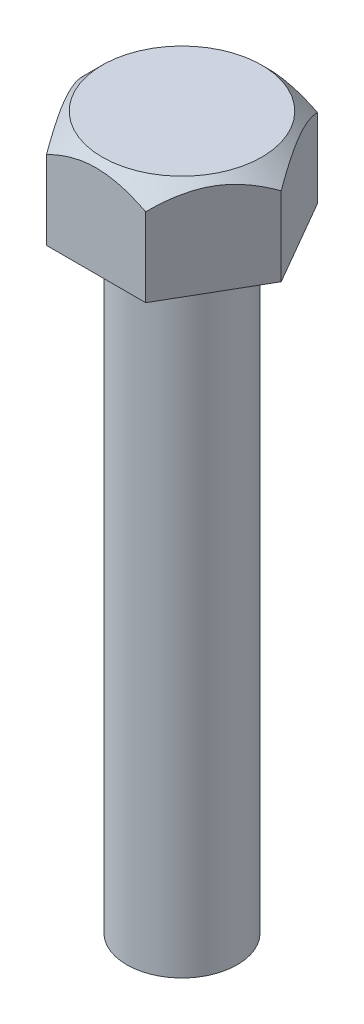
ISO-10303-21;
HEADER;
FILE_DESCRIPTION(('STEP AP214'),'2;1');
FILE_NAME('part.step','',(''),(''),'','','');
FILE_SCHEMA(('AUTOMOTIVE_DESIGN { 1 0 10303 214 1 1 1 1 }'));
ENDSEC;
DATA;
#1=APPLICATION_CONTEXT('core data for automotive mechanical design processes');
#2=APPLICATION_PROTOCOL_DEFINITION('international standard','automotive_design',2000,#1);
#3=PRODUCT_CONTEXT('',#1,'mechanical');
#4=PRODUCT('Part','Part','',(#3));
#5=PRODUCT_RELATED_PRODUCT_CATEGORY('part','',(#4));
#6=PRODUCT_DEFINITION_FORMATION('','',#4);
#7=PRODUCT_DEFINITION_CONTEXT('part definition',#1,'design');
#8=PRODUCT_DEFINITION('design','',#6,#7);
#9=PRODUCT_DEFINITION_SHAPE('','',#8);
#10=(LENGTH_UNIT() NAMED_UNIT(*) SI_UNIT(.MILLI.,.METRE.));
#11=(NAMED_UNIT(*) PLANE_ANGLE_UNIT() SI_UNIT($,.RADIAN.));
#12=(NAMED_UNIT(*) SI_UNIT($,.STERADIAN.) SOLID_ANGLE_UNIT());
#13=UNCERTAINTY_MEASURE_WITH_UNIT(LENGTH_MEASURE(1.E-05),#10,'distance_accuracy_value','');
#14=(GEOMETRIC_REPRESENTATION_CONTEXT(3) GLOBAL_UNCERTAINTY_ASSIGNED_CONTEXT((#13)) GLOBAL_UNIT_ASSIGNED_CONTEXT((#10,
#11,#12)) REPRESENTATION_CONTEXT('',''));
#15=CARTESIAN_POINT('',(0.,0.,0.));
#16=DIRECTION('',(0.,0.,1.));
#17=DIRECTION('',(1.,0.,0.));
#18=AXIS2_PLACEMENT_3D('',#15,#16,#17);
#19=CARTESIAN_POINT('',(2.02072594216369,29.,3.5));
#20=DIRECTION('',(-0.866025403784439,0.,-0.5));
#21=DIRECTION('',(-0.5,0.,0.866025403784439));
#22=AXIS2_PLACEMENT_3D('',#19,#20,#21);
#23=PLANE('',#22);
#24=CARTESIAN_POINT('',(2.02061047210985,28.2084326406702,3.5002));
#25=CARTESIAN_POINT('',(2.09007076582137,28.2778321819413,3.37989124218299));
#26=CARTESIAN_POINT('',(2.16069251433702,28.3431556368171,3.25757078563454));
#27=CARTESIAN_POINT('',(2.30469791501954,28.4627610639861,3.00814611508809));
#28=CARTESIAN_POINT('',(2.37809526074122,28.5169764927932,2.88101818315745));
#29=CARTESIAN_POINT('',(2.52609746963704,28.6098484404388,2.62467083771748));
#30=CARTESIAN_POINT('',(2.60066464532078,28.6487383754651,2.49551670085632));
#31=CARTESIAN_POINT('',(2.75144053111008,28.7086562112795,2.23436520611305));
#32=CARTESIAN_POINT('',(2.82764463582487,28.729728835325,2.10237582500172));
#33=CARTESIAN_POINT('',(2.9589800046599,28.7487420010243,1.87489629334866));
#34=CARTESIAN_POINT('',(3.01394167249194,28.7515564158127,1.77969989219485));
#35=CARTESIAN_POINT('',(3.12377560027761,28.7468134282327,1.58946194887522));
#36=CARTESIAN_POINT('',(3.17864782213826,28.7392523899156,1.49442047268838));
#37=CARTESIAN_POINT('',(3.28787240448756,28.7141902194182,1.3052379466239));
#38=CARTESIAN_POINT('',(3.34222411425439,28.6966779692925,1.21109802382951));
#39=CARTESIAN_POINT('',(3.4499940609728,28.6526692182783,1.02443500058423));
#40=CARTESIAN_POINT('',(3.50341236916323,28.6261734062083,0.931911776744037));
#41=CARTESIAN_POINT('',(3.59824414642312,28.5716601462383,0.767658320357847));
#42=CARTESIAN_POINT('',(3.63986754439452,28.5450758118228,0.695564480287723));
#43=CARTESIAN_POINT('',(3.72236709889696,28.4876227407093,0.552671060287706));
#44=CARTESIAN_POINT('',(3.76324323262423,28.4567538735092,0.481871519855082));
#45=CARTESIAN_POINT('',(3.84411947811356,28.3914237750285,0.341789753542154));
#46=CARTESIAN_POINT('',(3.88412189017022,28.3569738400217,0.272503543434723));
#47=CARTESIAN_POINT('',(3.96338588982946,28.2849340159573,0.135214268813787));
#48=CARTESIAN_POINT('',(4.00264791412852,28.2473460536121,0.0672104479198106));
#49=CARTESIAN_POINT('',(4.04156735438122,28.2084326406702,-0.000200000000000921));
#50=B_SPLINE_CURVE_WITH_KNOTS('',3,(#24,#25,#26,#27,#28,#29,#30,#31,#32,#33,#34,#35,#36,#37,#38,
#39,#40,#41,#42,#43,#44,#45,#46,#47,#48,#49),.UNSPECIFIED.,.F.,.F.,(4,2,2,2,2,2,2,2,2,2,2,2,4),
(0.,0.466195029511833,0.935106055247663,1.3965703522971,1.85687285909024,2.18628459516076,
2.51581179896771,2.845707891424,3.17557869467337,3.43762138891188,3.69967206642681,
3.96091985737577,4.22200840855896),.UNSPECIFIED.);
#51=CARTESIAN_POINT('',(2.02072594216369,28.2085481156726,3.5));
#52=VERTEX_POINT('',#51);
#53=CARTESIAN_POINT('',(4.04145188432738,28.2085481156726,0.));
#54=VERTEX_POINT('',#53);
#55=EDGE_CURVE('E92',#52,#54,#50,.T.);
#56=ORIENTED_EDGE('',*,*,#55,.F.);
#57=DIRECTION('',(0.,-1.,0.));
#58=VECTOR('',#57,1.);
#59=CARTESIAN_POINT('',(2.02072594216369,29.,3.5));
#60=LINE('',#59,#58);
#61=CARTESIAN_POINT('',(2.02072594216369,25.,3.5));
#62=VERTEX_POINT('',#61);
#63=EDGE_CURVE('E61',#52,#62,#60,.T.);
#64=ORIENTED_EDGE('',*,*,#63,.T.);
#65=DIRECTION('',(0.5,0.,-0.866025403784439));
#66=VECTOR('',#65,1.);
#67=CARTESIAN_POINT('',(2.02072594216369,25.,3.5));
#68=LINE('',#67,#66);
#69=CARTESIAN_POINT('',(4.04145188432738,25.,0.));
#70=VERTEX_POINT('',#69);
#71=EDGE_CURVE('E100',#62,#70,#68,.T.);
#72=ORIENTED_EDGE('',*,*,#71,.T.);
#73=DIRECTION('',(0.,-1.,0.));
#74=VECTOR('',#73,1.);
#75=CARTESIAN_POINT('',(4.04145188432738,29.,0.));
#76=LINE('',#75,#74);
#77=EDGE_CURVE('E99',#54,#70,#76,.T.);
#78=ORIENTED_EDGE('',*,*,#77,.F.);
#79=EDGE_LOOP('',(#56,#64,#72,#78));
#80=FACE_BOUND('',#79,.T.);
#81=ADVANCED_FACE('F38',(#80),#23,.F.);
#82=CARTESIAN_POINT('',(4.04145188432738,29.,0.));
#83=DIRECTION('',(-0.866025403784438,0.,0.5));
#84=DIRECTION('',(0.5,0.,0.866025403784438));
#85=AXIS2_PLACEMENT_3D('',#82,#83,#84);
#86=PLANE('',#85);
#87=CARTESIAN_POINT('',(4.04156735438122,28.2084326406702,0.000199999999999219));
#88=CARTESIAN_POINT('',(3.9721070606697,28.2778321819413,-0.120108757817011));
#89=CARTESIAN_POINT('',(3.90148531215405,28.3431556368171,-0.242429214365461));
#90=CARTESIAN_POINT('',(3.75747991147153,28.4627610639861,-0.491853884911908));
#91=CARTESIAN_POINT('',(3.68408256574985,28.5169764927932,-0.618981816842553));
#92=CARTESIAN_POINT('',(3.53608035685403,28.6098484404388,-0.875329162282526));
#93=CARTESIAN_POINT('',(3.46151318117029,28.6487383754651,-1.00448329914368));
#94=CARTESIAN_POINT('',(3.31073729538099,28.7086562112795,-1.26563479388695));
#95=CARTESIAN_POINT('',(3.2345331906662,28.729728835325,-1.39762417499828));
#96=CARTESIAN_POINT('',(3.10319782183117,28.7487420010243,-1.62510370665135));
#97=CARTESIAN_POINT('',(3.04823615399913,28.7515564158127,-1.72030010780516));
#98=CARTESIAN_POINT('',(2.93840222621346,28.7468134282327,-1.91053805112478));
#99=CARTESIAN_POINT('',(2.88353000435281,28.7392523899156,-2.00557952731162));
#100=CARTESIAN_POINT('',(2.77430542200351,28.7141902194182,-2.1947620533761));
#101=CARTESIAN_POINT('',(2.71995371223668,28.6966779692925,-2.2889019761705));
#102=CARTESIAN_POINT('',(2.61218376551827,28.6526692182783,-2.47556499941577));
#103=CARTESIAN_POINT('',(2.55876545732784,28.6261734062083,-2.56808822325597));
#104=CARTESIAN_POINT('',(2.46393368006795,28.5716601462383,-2.73234167964216));
#105=CARTESIAN_POINT('',(2.42231028209655,28.5450758118228,-2.80443551971228));
#106=CARTESIAN_POINT('',(2.33981072759411,28.4876227407093,-2.9473289397123));
#107=CARTESIAN_POINT('',(2.29893459386683,28.4567538735092,-3.01812848014492));
#108=CARTESIAN_POINT('',(2.21805834837751,28.3914237750285,-3.15821024645785));
#109=CARTESIAN_POINT('',(2.17805593632085,28.3569738400217,-3.22749645656528));
#110=CARTESIAN_POINT('',(2.09879193666161,28.2849340159573,-3.36478573118621));
#111=CARTESIAN_POINT('',(2.05952991236255,28.2473460536121,-3.43278955208019));
#112=CARTESIAN_POINT('',(2.02061047210985,28.2084326406702,-3.5002));
#113=B_SPLINE_CURVE_WITH_KNOTS('',3,(#87,#88,#89,#90,#91,#92,#93,#94,#95,#96,#97,#98,#99,#100,
#101,#102,#103,#104,#105,#106,#107,#108,#109,#110,#111,#112),.UNSPECIFIED.,.F.,.F.,(4,2,2,2,2,2,
2,2,2,2,2,2,4),(0.,0.466195029511835,0.935106055247666,1.3965703522971,1.85687285909025,
2.18628459516077,2.51581179896771,2.845707891424,3.17557869467337,3.43762138891189,
3.69967206642681,3.96091985737577,4.22200840855896),.UNSPECIFIED.);
#114=CARTESIAN_POINT('',(2.02072594216588,28.2085481156727,-3.5));
#115=VERTEX_POINT('',#114);
#116=EDGE_CURVE('E101',#54,#115,#113,.T.);
#117=ORIENTED_EDGE('',*,*,#116,.F.);
#118=ORIENTED_EDGE('',*,*,#77,.T.);
#119=DIRECTION('',(-0.5,0.,-0.866025403784438));
#120=VECTOR('',#119,1.);
#121=CARTESIAN_POINT('',(4.04145188432738,25.,0.));
#122=LINE('',#121,#120);
#123=CARTESIAN_POINT('',(2.02072594216369,25.,-3.5));
#124=VERTEX_POINT('',#123);
#125=EDGE_CURVE('E310',#70,#124,#122,.T.);
#126=ORIENTED_EDGE('',*,*,#125,.T.);
#127=DIRECTION('',(0.,-1.,0.));
#128=VECTOR('',#127,1.);
#129=CARTESIAN_POINT('',(2.02072594216369,29.,-3.5));
#130=LINE('',#129,#128);
#131=EDGE_CURVE('E118',#115,#124,#130,.T.);
#132=ORIENTED_EDGE('',*,*,#131,.F.);
#133=EDGE_LOOP('',(#117,#118,#126,#132));
#134=FACE_BOUND('',#133,.T.);
#135=ADVANCED_FACE('F139',(#134),#86,.F.);
#136=CARTESIAN_POINT('',(2.02072594216369,29.,-3.5));
#137=DIRECTION('',(0.,0.,1.));
#138=DIRECTION('',(1.,0.,0.));
#139=AXIS2_PLACEMENT_3D('',#136,#137,#138);
#140=PLANE('',#139);
#141=CARTESIAN_POINT('',(7.70716664524102,23.7853430254076,-3.5));
#142=CARTESIAN_POINT('',(7.48137878493621,23.990864738311,-3.5));
#143=CARTESIAN_POINT('',(7.25487498305033,24.1956103190715,-3.5));
#144=CARTESIAN_POINT('',(6.79984084265897,24.6029554533115,-3.5));
#145=CARTESIAN_POINT('',(6.57130998936556,24.8055544312053,-3.5));
#146=CARTESIAN_POINT('',(6.10997227237162,25.2094561203308,-3.5));
#147=CARTESIAN_POINT('',(5.87714602281739,25.4107367785887,-3.5));
#148=CARTESIAN_POINT('',(5.52538737480416,25.7096554363448,-3.5));
#149=CARTESIAN_POINT('',(5.40772405447227,25.8087868497351,-3.5));
#150=CARTESIAN_POINT('',(5.17140128385372,26.0058714944853,-3.5));
#151=CARTESIAN_POINT('',(5.05274176897768,26.1038246484339,-3.5));
#152=CARTESIAN_POINT('',(4.72855665814677,26.3682372764227,-3.5));
#153=CARTESIAN_POINT('',(4.52190647560976,26.5333236577724,-3.5));
#154=CARTESIAN_POINT('',(4.10413126511783,26.857737279714,-3.5));
#155=CARTESIAN_POINT('',(3.89300676148951,27.0170651892613,-3.5));
#156=CARTESIAN_POINT('',(3.57190983710472,27.2496843353503,-3.5));
#157=CARTESIAN_POINT('',(3.46421302882779,27.3261149199009,-3.5));
#158=CARTESIAN_POINT('',(3.24704746965091,27.4764102809614,-3.5));
#159=CARTESIAN_POINT('',(3.13757882856852,27.5502752156033,-3.5));
#160=CARTESIAN_POINT('',(2.91663090789853,27.6948095752396,-3.5));
#161=CARTESIAN_POINT('',(2.805152799562,27.7654807825477,-3.5));
#162=CARTESIAN_POINT('',(2.57979608614745,27.9028900075283,-3.5));
#163=CARTESIAN_POINT('',(2.46591757085952,27.9696281719677,-3.5));
#164=CARTESIAN_POINT('',(2.23926046454426,28.0959963731595,-3.5));
#165=CARTESIAN_POINT('',(2.12657447565633,28.1557902941685,-3.5));
#166=CARTESIAN_POINT('',(1.89832432470709,28.2695697545064,-3.5));
#167=CARTESIAN_POINT('',(1.78275963062833,28.3235542102242,-3.5));
#168=CARTESIAN_POINT('',(1.43160000307182,28.4744265078049,-3.5));
#169=CARTESIAN_POINT('',(1.19096103072813,28.5605724518729,-3.5));
#170=CARTESIAN_POINT('',(0.844192800517524,28.6509389744605,-3.5));
#171=CARTESIAN_POINT('',(0.742755831599193,28.6734700859226,-3.5));
#172=CARTESIAN_POINT('',(0.538372515731154,28.710260537644,-3.5));
#173=CARTESIAN_POINT('',(0.435426387793829,28.7245210661996,-3.5));
#174=CARTESIAN_POINT('',(0.228874710706779,28.7440284506105,-3.5));
#175=CARTESIAN_POINT('',(0.125270816613507,28.7492926404895,-3.5));
#176=CARTESIAN_POINT('',(-0.0819976482621305,28.7505736059931,-3.5));
#177=CARTESIAN_POINT('',(-0.185662219919042,28.7465902448792,-3.5));
#178=CARTESIAN_POINT('',(-0.391954552758978,28.7296186785698,-3.5));
#179=CARTESIAN_POINT('',(-0.494584371532753,28.7166550805322,-3.5));
#180=CARTESIAN_POINT('',(-0.69845096177407,28.6824060166348,-3.5));
#181=CARTESIAN_POINT('',(-0.799687393970877,28.6611185598784,-3.5));
#182=CARTESIAN_POINT('',(-1.00055886357535,28.6110957151298,-3.5));
#183=CARTESIAN_POINT('',(-1.10018908438169,28.5823412147177,-3.5));
#184=CARTESIAN_POINT('',(-1.29735290848498,28.5184556116406,-3.5));
#185=CARTESIAN_POINT('',(-1.39488662725708,28.4833248611907,-3.5));
#186=CARTESIAN_POINT('',(-1.62398143894392,28.393522835092,-3.5));
#187=CARTESIAN_POINT('',(-1.75460225208164,28.3364614936028,-3.5));
#188=CARTESIAN_POINT('',(-2.01212538243932,28.2144355971307,-3.5));
#189=CARTESIAN_POINT('',(-2.13902566051998,28.1494668051478,-3.5));
#190=CARTESIAN_POINT('',(-2.38975030564642,28.0132787478499,-3.5));
#191=CARTESIAN_POINT('',(-2.51356756500158,27.9420464963877,-3.5));
#192=CARTESIAN_POINT('',(-2.75828903960432,27.7948220965912,-3.5));
#193=CARTESIAN_POINT('',(-2.87919376849558,27.7188307961824,-3.5));
#194=CARTESIAN_POINT('',(-3.11981544610214,27.5622695569284,-3.5));
#195=CARTESIAN_POINT('',(-3.23950628239306,27.4816596727114,-3.5));
#196=CARTESIAN_POINT('',(-3.47678034146727,27.3173864559665,-3.5));
#197=CARTESIAN_POINT('',(-3.59436338889632,27.2337228711325,-3.5));
#198=CARTESIAN_POINT('',(-3.82759534323741,27.0640483819622,-3.5));
#199=CARTESIAN_POINT('',(-3.94324646957738,26.9780405198824,-3.5));
#200=CARTESIAN_POINT('',(-4.17303756356098,26.8040274731239,-3.5));
#201=CARTESIAN_POINT('',(-4.28717748943524,26.7160222334197,-3.5));
#202=CARTESIAN_POINT('',(-4.54597443286471,26.5134775488887,-3.5));
#203=CARTESIAN_POINT('',(-4.69022023284845,26.3984132003865,-3.5));
#204=CARTESIAN_POINT('',(-4.97697874841413,26.166146458185,-3.5));
#205=CARTESIAN_POINT('',(-5.11949143591914,26.0489440299248,-3.5));
#206=CARTESIAN_POINT('',(-5.54501613076944,25.6946694881432,-3.5));
#207=CARTESIAN_POINT('',(-5.82588928926461,25.4550295631682,-3.5));
#208=CARTESIAN_POINT('',(-6.37505783002073,24.9785890776849,-3.5));
#209=CARTESIAN_POINT('',(-6.64347451864522,24.7419274895939,-3.5));
#210=CARTESIAN_POINT('',(-7.04391472975608,24.3846885484034,-3.5));
#211=CARTESIAN_POINT('',(-7.17698223407642,24.2652787040679,-3.5));
#212=CARTESIAN_POINT('',(-7.44250845068641,24.0257883304083,-3.5));
#213=CARTESIAN_POINT('',(-7.57496717311672,23.9057078123301,-3.5));
#214=CARTESIAN_POINT('',(-7.70716664524102,23.7853430254076,-3.5));
#215=B_SPLINE_CURVE_WITH_KNOTS('',3,(#141,#142,#143,#144,#145,#146,#147,#148,#149,#150,#151,
#152,#153,#154,#155,#156,#157,#158,#159,#160,#161,#162,#163,#164,#165,#166,#167,#168,#169,#170,
#171,#172,#173,#174,#175,#176,#177,#178,#179,#180,#181,#182,#183,#184,#185,#186,#187,#188,#189,
#190,#191,#192,#193,#194,#195,#196,#197,#198,#199,#200,#201,#202,#203,#204,#205,#206,#207,#208,
#209,#210,#211,#212,#213,#214),.UNSPECIFIED.,.F.,.F.,(4,2,2,2,2,2,2,2,2,2,2,2,2,2,2,2,2,2,2,2,2,
2,2,2,2,2,2,2,2,2,2,2,2,2,2,2,4),(0.,0.915963363141742,1.8321664126931,2.75543658827209,
3.21699839490496,3.67859036214388,4.47201065044676,5.26533846978212,5.66149422375699,
6.05762551745641,6.45353294218932,6.84942558372157,7.23195625738918,7.6145581594123,
8.3777588455119,8.68921200357338,9.00062040174318,9.31142810308282,9.62224040019004,
9.93220437785494,10.2422425379534,10.5530822212853,10.8639047394964,11.2911653487573,
11.7186559107035,12.1470546944636,12.5753773658633,13.0082330710391,13.4411246213995,
13.8734788882472,14.3058450804653,14.8593699513852,15.412903777658,16.5204516115594,
17.5939713743935,18.1303377588253,18.6666951762194),.UNSPECIFIED.);
#216=CARTESIAN_POINT('',(-2.02072594216369,28.2085481156726,-3.5));
#217=VERTEX_POINT('',#216);
#218=EDGE_CURVE('E190',#115,#217,#215,.T.);
#219=ORIENTED_EDGE('',*,*,#218,.F.);
#220=ORIENTED_EDGE('',*,*,#131,.T.);
#221=DIRECTION('',(-1.,0.,0.));
#222=VECTOR('',#221,1.);
#223=CARTESIAN_POINT('',(2.02072594216369,25.,-3.5));
#224=LINE('',#223,#222);
#225=CARTESIAN_POINT('',(-2.02072594216369,25.,-3.5));
#226=VERTEX_POINT('',#225);
#227=EDGE_CURVE('E307',#124,#226,#224,.T.);
#228=ORIENTED_EDGE('',*,*,#227,.T.);
#229=DIRECTION('',(0.,-1.,0.));
#230=VECTOR('',#229,1.);
#231=CARTESIAN_POINT('',(-2.02072594216369,29.,-3.5));
#232=LINE('',#231,#230);
#233=EDGE_CURVE('E116',#217,#226,#232,.T.);
#234=ORIENTED_EDGE('',*,*,#233,.F.);
#235=EDGE_LOOP('',(#219,#220,#228,#234));
#236=FACE_BOUND('',#235,.T.);
#237=ADVANCED_FACE('F143',(#236),#140,.F.);
#238=CARTESIAN_POINT('',(-2.02072594216369,29.,-3.5));
#239=DIRECTION('',(0.866025403784439,0.,0.5));
#240=DIRECTION('',(0.5,0.,-0.866025403784439));
#241=AXIS2_PLACEMENT_3D('',#238,#239,#240);
#242=PLANE('',#241);
#243=CARTESIAN_POINT('',(-2.02061047210985,28.2084326406702,-3.5002));
#244=CARTESIAN_POINT('',(-2.09007076582137,28.2778321819413,-3.37989124218299));
#245=CARTESIAN_POINT('',(-2.16069251433702,28.3431556368171,-3.25757078563454));
#246=CARTESIAN_POINT('',(-2.30469791501954,28.4627610639861,-3.00814611508809));
#247=CARTESIAN_POINT('',(-2.37809526074122,28.5169764927932,-2.88101818315745));
#248=CARTESIAN_POINT('',(-2.52609746963703,28.6098484404388,-2.62467083771748));
#249=CARTESIAN_POINT('',(-2.60066464532078,28.6487383754651,-2.49551670085632));
#250=CARTESIAN_POINT('',(-2.75144053111008,28.7086562112795,-2.23436520611305));
#251=CARTESIAN_POINT('',(-2.82764463582487,28.729728835325,-2.10237582500172));
#252=CARTESIAN_POINT('',(-2.9589800046599,28.7487420010243,-1.87489629334865));
#253=CARTESIAN_POINT('',(-3.01394167249194,28.7515564158127,-1.77969989219484));
#254=CARTESIAN_POINT('',(-3.12377560027761,28.7468134282327,-1.58946194887522));
#255=CARTESIAN_POINT('',(-3.17864782213826,28.7392523899156,-1.49442047268838));
#256=CARTESIAN_POINT('',(-3.28787240448756,28.7141902194182,-1.3052379466239));
#257=CARTESIAN_POINT('',(-3.34222411425439,28.6966779692925,-1.2110980238295));
#258=CARTESIAN_POINT('',(-3.4499940609728,28.6526692182783,-1.02443500058423));
#259=CARTESIAN_POINT('',(-3.50341236916323,28.6261734062083,-0.931911776744034));
#260=CARTESIAN_POINT('',(-3.59824414642312,28.5716601462383,-0.767658320357843));
#261=CARTESIAN_POINT('',(-3.63986754439452,28.5450758118228,-0.695564480287718));
#262=CARTESIAN_POINT('',(-3.72236709889696,28.4876227407093,-0.552671060287703));
#263=CARTESIAN_POINT('',(-3.76324323262423,28.4567538735092,-0.48187151985508));
#264=CARTESIAN_POINT('',(-3.84411947811356,28.3914237750285,-0.341789753542153));
#265=CARTESIAN_POINT('',(-3.88412189017022,28.3569738400217,-0.272503543434722));
#266=CARTESIAN_POINT('',(-3.96338588982946,28.2849340159573,-0.135214268813785));
#267=CARTESIAN_POINT('',(-4.00264791412852,28.2473460536121,-0.0672104479198091));
#268=CARTESIAN_POINT('',(-4.04156735438122,28.2084326406702,0.000200000000000683));
#269=B_SPLINE_CURVE_WITH_KNOTS('',3,(#243,#244,#245,#246,#247,#248,#249,#250,#251,#252,#253,
#254,#255,#256,#257,#258,#259,#260,#261,#262,#263,#264,#265,#266,#267,#268),.UNSPECIFIED.,.F.,
.F.,(4,2,2,2,2,2,2,2,2,2,2,2,4),(0.,0.466195029511834,0.935106055247666,1.3965703522971,
1.85687285909025,2.18628459516077,2.51581179896772,2.845707891424,3.17557869467338,
3.43762138891189,3.69967206642681,3.96091985737577,4.22200840855896),.UNSPECIFIED.);
#270=CARTESIAN_POINT('',(-4.04145188432738,28.2085481156726,0.));
#271=VERTEX_POINT('',#270);
#272=EDGE_CURVE('E184',#217,#271,#269,.T.);
#273=ORIENTED_EDGE('',*,*,#272,.F.);
#274=ORIENTED_EDGE('',*,*,#233,.T.);
#275=DIRECTION('',(-0.5,0.,0.866025403784439));
#276=VECTOR('',#275,1.);
#277=CARTESIAN_POINT('',(-2.02072594216369,25.,-3.5));
#278=LINE('',#277,#276);
#279=CARTESIAN_POINT('',(-4.04145188432738,25.,0.));
#280=VERTEX_POINT('',#279);
#281=EDGE_CURVE('E302',#226,#280,#278,.T.);
#282=ORIENTED_EDGE('',*,*,#281,.T.);
#283=DIRECTION('',(0.,-1.,0.));
#284=VECTOR('',#283,1.);
#285=CARTESIAN_POINT('',(-4.04145188432738,29.,0.));
#286=LINE('',#285,#284);
#287=EDGE_CURVE('E109',#271,#280,#286,.T.);
#288=ORIENTED_EDGE('',*,*,#287,.F.);
#289=EDGE_LOOP('',(#273,#274,#282,#288));
#290=FACE_BOUND('',#289,.T.);
#291=ADVANCED_FACE('F197',(#290),#242,.F.);
#292=CARTESIAN_POINT('',(-4.04145188432738,29.,0.));
#293=DIRECTION('',(0.866025403784439,0.,-0.5));
#294=DIRECTION('',(-0.5,0.,-0.866025403784439));
#295=AXIS2_PLACEMENT_3D('',#292,#293,#294);
#296=PLANE('',#295);
#297=CARTESIAN_POINT('',(-4.04156735438122,28.2084326406702,-0.000199999999999135));
#298=CARTESIAN_POINT('',(-3.9721070606697,28.2778321819413,0.12010875781701));
#299=CARTESIAN_POINT('',(-3.90148531215405,28.3431556368171,0.24242921436546));
#300=CARTESIAN_POINT('',(-3.75747991147153,28.4627610639861,0.491853884911908));
#301=CARTESIAN_POINT('',(-3.68408256574985,28.5169764927932,0.618981816842554));
#302=CARTESIAN_POINT('',(-3.53608035685403,28.6098484404388,0.875329162282526));
#303=CARTESIAN_POINT('',(-3.46151318117029,28.6487383754651,1.00448329914368));
#304=CARTESIAN_POINT('',(-3.31073729538099,28.7086562112795,1.26563479388695));
#305=CARTESIAN_POINT('',(-3.23453319066619,28.729728835325,1.39762417499828));
#306=CARTESIAN_POINT('',(-3.10319782183117,28.7487420010243,1.62510370665135));
#307=CARTESIAN_POINT('',(-3.04823615399913,28.7515564158127,1.72030010780516));
#308=CARTESIAN_POINT('',(-2.93840222621346,28.7468134282327,1.91053805112478));
#309=CARTESIAN_POINT('',(-2.88353000435281,28.7392523899156,2.00557952731162));
#310=CARTESIAN_POINT('',(-2.77430542200351,28.7141902194182,2.1947620533761));
#311=CARTESIAN_POINT('',(-2.71995371223668,28.6966779692925,2.2889019761705));
#312=CARTESIAN_POINT('',(-2.61218376551827,28.6526692182783,2.47556499941577));
#313=CARTESIAN_POINT('',(-2.55876545732784,28.6261734062083,2.56808822325597));
#314=CARTESIAN_POINT('',(-2.46393368006795,28.5716601462383,2.73234167964216));
#315=CARTESIAN_POINT('',(-2.42231028209655,28.5450758118228,2.80443551971228));
#316=CARTESIAN_POINT('',(-2.33981072759411,28.4876227407093,2.9473289397123));
#317=CARTESIAN_POINT('',(-2.29893459386683,28.4567538735092,3.01812848014492));
#318=CARTESIAN_POINT('',(-2.21805834837751,28.3914237750285,3.15821024645785));
#319=CARTESIAN_POINT('',(-2.17805593632085,28.3569738400216,3.22749645656528));
#320=CARTESIAN_POINT('',(-2.09879193666161,28.2849340159573,3.36478573118621));
#321=CARTESIAN_POINT('',(-2.05952991236255,28.2473460536121,3.43278955208019));
#322=CARTESIAN_POINT('',(-2.02061047210985,28.2084326406702,3.5002));
#323=B_SPLINE_CURVE_WITH_KNOTS('',3,(#297,#298,#299,#300,#301,#302,#303,#304,#305,#306,#307,
#308,#309,#310,#311,#312,#313,#314,#315,#316,#317,#318,#319,#320,#321,#322),.UNSPECIFIED.,.F.,
.F.,(4,2,2,2,2,2,2,2,2,2,2,2,4),(0.,0.466195029511834,0.935106055247666,1.3965703522971,
1.85687285909025,2.18628459516077,2.51581179896771,2.845707891424,3.17557869467337,
3.43762138891189,3.69967206642681,3.96091985737577,4.22200840855896),.UNSPECIFIED.);
#324=CARTESIAN_POINT('',(-2.02072594216369,28.2085481156726,3.5));
#325=VERTEX_POINT('',#324);
#326=EDGE_CURVE('E53',#271,#325,#323,.T.);
#327=ORIENTED_EDGE('',*,*,#326,.F.);
#328=ORIENTED_EDGE('',*,*,#287,.T.);
#329=DIRECTION('',(0.5,0.,0.866025403784439));
#330=VECTOR('',#329,1.);
#331=CARTESIAN_POINT('',(-4.04145188432738,25.,0.));
#332=LINE('',#331,#330);
#333=CARTESIAN_POINT('',(-2.02072594216369,25.,3.5));
#334=VERTEX_POINT('',#333);
#335=EDGE_CURVE('E111',#280,#334,#332,.T.);
#336=ORIENTED_EDGE('',*,*,#335,.T.);
#337=DIRECTION('',(0.,-1.,0.));
#338=VECTOR('',#337,1.);
#339=CARTESIAN_POINT('',(-2.02072594216369,29.,3.5));
#340=LINE('',#339,#338);
#341=EDGE_CURVE('E107',#325,#334,#340,.T.);
#342=ORIENTED_EDGE('',*,*,#341,.F.);
#343=EDGE_LOOP('',(#327,#328,#336,#342));
#344=FACE_BOUND('',#343,.T.);
#345=ADVANCED_FACE('F201',(#344),#296,.F.);
#346=CARTESIAN_POINT('',(-2.02072594216369,29.,3.5));
#347=DIRECTION('',(0.,0.,-1.));
#348=DIRECTION('',(-1.,0.,0.));
#349=AXIS2_PLACEMENT_3D('',#346,#347,#348);
#350=PLANE('',#349);
#351=CARTESIAN_POINT('',(-7.70716664524102,23.7853430254076,3.5));
#352=CARTESIAN_POINT('',(-7.48137878493621,23.990864738311,3.5));
#353=CARTESIAN_POINT('',(-7.25487498305033,24.1956103190715,3.5));
#354=CARTESIAN_POINT('',(-6.79984084265897,24.6029554533115,3.5));
#355=CARTESIAN_POINT('',(-6.57130998936556,24.8055544312053,3.5));
#356=CARTESIAN_POINT('',(-6.10997227237161,25.2094561203308,3.5));
#357=CARTESIAN_POINT('',(-5.87714602281739,25.4107367785887,3.5));
#358=CARTESIAN_POINT('',(-5.52538737480416,25.7096554363448,3.5));
#359=CARTESIAN_POINT('',(-5.40772405447227,25.8087868497351,3.5));
#360=CARTESIAN_POINT('',(-5.17140128385372,26.0058714944853,3.5));
#361=CARTESIAN_POINT('',(-5.05274176897768,26.1038246484339,3.5));
#362=CARTESIAN_POINT('',(-4.72855665814677,26.3682372764227,3.5));
#363=CARTESIAN_POINT('',(-4.52190647560975,26.5333236577724,3.5));
#364=CARTESIAN_POINT('',(-4.10413126511783,26.857737279714,3.5));
#365=CARTESIAN_POINT('',(-3.89300676148951,27.0170651892613,3.5));
#366=CARTESIAN_POINT('',(-3.57190983710472,27.2496843353503,3.5));
#367=CARTESIAN_POINT('',(-3.46421302882779,27.3261149199009,3.5));
#368=CARTESIAN_POINT('',(-3.24704746965091,27.4764102809614,3.5));
#369=CARTESIAN_POINT('',(-3.13757882856852,27.5502752156033,3.5));
#370=CARTESIAN_POINT('',(-2.91663090789853,27.6948095752396,3.5));
#371=CARTESIAN_POINT('',(-2.805152799562,27.7654807825477,3.5));
#372=CARTESIAN_POINT('',(-2.57979608614745,27.9028900075283,3.5));
#373=CARTESIAN_POINT('',(-2.46591757085952,27.9696281719677,3.5));
#374=CARTESIAN_POINT('',(-2.23926046454426,28.0959963731595,3.5));
#375=CARTESIAN_POINT('',(-2.12657447565633,28.1557902941685,3.5));
#376=CARTESIAN_POINT('',(-1.89832432470709,28.2695697545064,3.5));
#377=CARTESIAN_POINT('',(-1.78275963062833,28.3235542102242,3.5));
#378=CARTESIAN_POINT('',(-1.43160000307182,28.4744265078049,3.5));
#379=CARTESIAN_POINT('',(-1.19096103072814,28.5605724518729,3.5));
#380=CARTESIAN_POINT('',(-0.844192800517525,28.6509389744605,3.5));
#381=CARTESIAN_POINT('',(-0.742755831599195,28.6734700859226,3.5));
#382=CARTESIAN_POINT('',(-0.538372515731155,28.710260537644,3.5));
#383=CARTESIAN_POINT('',(-0.435426387793831,28.7245210661996,3.5));
#384=CARTESIAN_POINT('',(-0.22887471070678,28.7440284506105,3.5));
#385=CARTESIAN_POINT('',(-0.125270816613508,28.7492926404896,3.5));
#386=CARTESIAN_POINT('',(0.0819976482621295,28.7505736059931,3.5));
#387=CARTESIAN_POINT('',(0.185662219919041,28.7465902448792,3.5));
#388=CARTESIAN_POINT('',(0.391954552758978,28.7296186785698,3.5));
#389=CARTESIAN_POINT('',(0.494584371532753,28.7166550805322,3.5));
#390=CARTESIAN_POINT('',(0.69845096177407,28.6824060166348,3.5));
#391=CARTESIAN_POINT('',(0.799687393970876,28.6611185598784,3.5));
#392=CARTESIAN_POINT('',(1.00055886357535,28.6110957151298,3.5));
#393=CARTESIAN_POINT('',(1.10018908438169,28.5823412147177,3.5));
#394=CARTESIAN_POINT('',(1.29735290848498,28.5184556116406,3.5));
#395=CARTESIAN_POINT('',(1.39488662725708,28.4833248611907,3.5));
#396=CARTESIAN_POINT('',(1.62398143894392,28.393522835092,3.5));
#397=CARTESIAN_POINT('',(1.75460225208164,28.3364614936028,3.5));
#398=CARTESIAN_POINT('',(2.01212538243932,28.2144355971307,3.5));
#399=CARTESIAN_POINT('',(2.13902566051998,28.1494668051478,3.5));
#400=CARTESIAN_POINT('',(2.38975030564642,28.0132787478499,3.5));
#401=CARTESIAN_POINT('',(2.51356756500158,27.9420464963877,3.5));
#402=CARTESIAN_POINT('',(2.75828903960432,27.7948220965912,3.5));
#403=CARTESIAN_POINT('',(2.87919376849558,27.7188307961824,3.5));
#404=CARTESIAN_POINT('',(3.11981544610214,27.5622695569284,3.5));
#405=CARTESIAN_POINT('',(3.23950628239306,27.4816596727114,3.5));
#406=CARTESIAN_POINT('',(3.47678034146727,27.3173864559665,3.5));
#407=CARTESIAN_POINT('',(3.59436338889632,27.2337228711325,3.5));
#408=CARTESIAN_POINT('',(3.8275953432374,27.0640483819622,3.5));
#409=CARTESIAN_POINT('',(3.94324646957737,26.9780405198824,3.5));
#410=CARTESIAN_POINT('',(4.17303756356097,26.8040274731239,3.5));
#411=CARTESIAN_POINT('',(4.28717748943523,26.7160222334197,3.5));
#412=CARTESIAN_POINT('',(4.5459744328647,26.5134775488887,3.5));
#413=CARTESIAN_POINT('',(4.69022023284844,26.3984132003865,3.5));
#414=CARTESIAN_POINT('',(4.97697874841412,26.166146458185,3.5));
#415=CARTESIAN_POINT('',(5.11949143591913,26.0489440299248,3.5));
#416=CARTESIAN_POINT('',(5.54501613076943,25.6946694881432,3.5));
#417=CARTESIAN_POINT('',(5.82588928926461,25.4550295631683,3.5));
#418=CARTESIAN_POINT('',(6.37505783002073,24.9785890776849,3.5));
#419=CARTESIAN_POINT('',(6.64347451864521,24.7419274895939,3.5));
#420=CARTESIAN_POINT('',(7.04391472975607,24.3846885484034,3.5));
#421=CARTESIAN_POINT('',(7.17698223407642,24.2652787040679,3.5));
#422=CARTESIAN_POINT('',(7.44250845068641,24.0257883304083,3.5));
#423=CARTESIAN_POINT('',(7.57496717311672,23.9057078123301,3.5));
#424=CARTESIAN_POINT('',(7.70716664524102,23.7853430254076,3.5));
#425=B_SPLINE_CURVE_WITH_KNOTS('',3,(#351,#352,#353,#354,#355,#356,#357,#358,#359,#360,#361,
#362,#363,#364,#365,#366,#367,#368,#369,#370,#371,#372,#373,#374,#375,#376,#377,#378,#379,#380,
#381,#382,#383,#384,#385,#386,#387,#388,#389,#390,#391,#392,#393,#394,#395,#396,#397,#398,#399,
#400,#401,#402,#403,#404,#405,#406,#407,#408,#409,#410,#411,#412,#413,#414,#415,#416,#417,#418,
#419,#420,#421,#422,#423,#424),.UNSPECIFIED.,.F.,.F.,(4,2,2,2,2,2,2,2,2,2,2,2,2,2,2,2,2,2,2,2,2,
2,2,2,2,2,2,2,2,2,2,2,2,2,2,2,4),(0.,0.915963363141743,1.8321664126931,2.75543658827209,
3.21699839490496,3.67859036214388,4.47201065044676,5.26533846978212,5.66149422375699,
6.05762551745641,6.45353294218932,6.84942558372157,7.23195625738918,7.6145581594123,
8.3777588455119,8.68921200357338,9.00062040174318,9.31142810308282,9.62224040019004,
9.93220437785494,10.2422425379534,10.5530822212853,10.8639047394964,11.2911653487573,
11.7186559107035,12.1470546944636,12.5753773658633,13.0082330710391,13.4411246213995,
13.8734788882472,14.3058450804653,14.8593699513852,15.412903777658,16.5204516115594,
17.5939713743935,18.1303377588253,18.6666951762194),.UNSPECIFIED.);
#426=EDGE_CURVE('E90',#325,#52,#425,.T.);
#427=ORIENTED_EDGE('',*,*,#426,.F.);
#428=ORIENTED_EDGE('',*,*,#341,.T.);
#429=DIRECTION('',(1.,0.,0.));
#430=VECTOR('',#429,1.);
#431=CARTESIAN_POINT('',(-2.02072594216369,25.,3.5));
#432=LINE('',#431,#430);
#433=EDGE_CURVE('E105',#334,#62,#432,.T.);
#434=ORIENTED_EDGE('',*,*,#433,.T.);
#435=ORIENTED_EDGE('',*,*,#63,.F.);
#436=EDGE_LOOP('',(#427,#428,#434,#435));
#437=FACE_BOUND('',#436,.T.);
#438=ADVANCED_FACE('F103',(#437),#350,.F.);
#439=CARTESIAN_POINT('',(0.,25.,0.));
#440=DIRECTION('',(0.,-1.,0.));
#441=DIRECTION('',(0.,0.,-1.));
#442=AXIS2_PLACEMENT_3D('',#439,#440,#441);
#443=CYLINDRICAL_SURFACE('',#442,2.25);
#444=CARTESIAN_POINT('',(0.,25.,0.));
#445=DIRECTION('',(0.,1.,0.));
#446=DIRECTION('',(0.,0.,1.));
#447=AXIS2_PLACEMENT_3D('',#444,#445,#446);
#448=CIRCLE('',#447,2.25);
#449=CARTESIAN_POINT('',(0.,25.,2.25));
#450=VERTEX_POINT('',#449);
#451=EDGE_CURVE('E12',#450,#450,#448,.T.);
#452=ORIENTED_EDGE('',*,*,#451,.F.);
#453=EDGE_LOOP('',(#452));
#454=FACE_BOUND('',#453,.T.);
#455=CARTESIAN_POINT('',(0.,0.,0.));
#456=DIRECTION('',(0.,1.,0.));
#457=DIRECTION('',(0.,0.,1.));
#458=AXIS2_PLACEMENT_3D('',#455,#456,#457);
#459=CIRCLE('',#458,2.25);
#460=CARTESIAN_POINT('',(0.,0.,2.25));
#461=VERTEX_POINT('',#460);
#462=EDGE_CURVE('E42',#461,#461,#459,.T.);
#463=ORIENTED_EDGE('',*,*,#462,.T.);
#464=EDGE_LOOP('',(#463));
#465=FACE_BOUND('',#464,.T.);
#466=ADVANCED_FACE('F40',(#454,#465),#443,.T.);
#467=CARTESIAN_POINT('',(0.,0.,0.));
#468=DIRECTION('',(0.,1.,0.));
#469=DIRECTION('',(0.,0.,1.));
#470=AXIS2_PLACEMENT_3D('',#467,#468,#469);
#471=PLANE('',#470);
#472=ORIENTED_EDGE('',*,*,#462,.F.);
#473=EDGE_LOOP('',(#472));
#474=FACE_BOUND('',#473,.T.);
#475=ADVANCED_FACE('F127',(#474),#471,.F.);
#476=CARTESIAN_POINT('',(0.,25.,0.));
#477=DIRECTION('',(0.,1.,0.));
#478=DIRECTION('',(0.,0.,1.));
#479=AXIS2_PLACEMENT_3D('',#476,#477,#478);
#480=PLANE('',#479);
#481=ORIENTED_EDGE('',*,*,#451,.T.);
#482=EDGE_LOOP('',(#481));
#483=FACE_BOUND('',#482,.T.);
#484=ORIENTED_EDGE('',*,*,#71,.F.);
#485=ORIENTED_EDGE('',*,*,#433,.F.);
#486=ORIENTED_EDGE('',*,*,#335,.F.);
#487=ORIENTED_EDGE('',*,*,#281,.F.);
#488=ORIENTED_EDGE('',*,*,#227,.F.);
#489=ORIENTED_EDGE('',*,*,#125,.F.);
#490=EDGE_LOOP('',(#484,#485,#486,#487,#488,#489));
#491=FACE_BOUND('',#490,.T.);
#492=ADVANCED_FACE('F129',(#483,#491),#480,.F.);
#493=CARTESIAN_POINT('',(0.,29.,0.));
#494=DIRECTION('',(0.,-1.,0.));
#495=DIRECTION('',(0.,0.,1.));
#496=AXIS2_PLACEMENT_3D('',#493,#494,#495);
#497=CONICAL_SURFACE('',#496,3.25,0.78539816339745);
#498=CARTESIAN_POINT('',(0.,29.,0.));
#499=DIRECTION('',(0.,1.,0.));
#500=DIRECTION('',(0.,0.,1.));
#501=AXIS2_PLACEMENT_3D('',#498,#499,#500);
#502=CIRCLE('',#501,3.25);
#503=CARTESIAN_POINT('',(0.,29.,3.25));
#504=VERTEX_POINT('',#503);
#505=EDGE_CURVE('E96',#504,#504,#502,.T.);
#506=ORIENTED_EDGE('',*,*,#505,.F.);
#507=EDGE_LOOP('',(#506));
#508=FACE_BOUND('',#507,.T.);
#509=ORIENTED_EDGE('',*,*,#55,.T.);
#510=ORIENTED_EDGE('',*,*,#116,.T.);
#511=ORIENTED_EDGE('',*,*,#218,.T.);
#512=ORIENTED_EDGE('',*,*,#272,.T.);
#513=ORIENTED_EDGE('',*,*,#326,.T.);
#514=ORIENTED_EDGE('',*,*,#426,.T.);
#515=EDGE_LOOP('',(#509,#510,#511,#512,#513,#514));
#516=FACE_BOUND('',#515,.T.);
#517=ADVANCED_FACE('F91',(#508,#516),#497,.T.);
#518=CARTESIAN_POINT('',(0.,29.,0.));
#519=DIRECTION('',(0.,1.,0.));
#520=DIRECTION('',(0.,0.,1.));
#521=AXIS2_PLACEMENT_3D('',#518,#519,#520);
#522=PLANE('',#521);
#523=ORIENTED_EDGE('',*,*,#505,.T.);
#524=EDGE_LOOP('',(#523));
#525=FACE_BOUND('',#524,.T.);
#526=ADVANCED_FACE('F164',(#525),#522,.T.);
#527=CLOSED_SHELL('',(#81,#135,#237,#291,#345,#438,#466,#475,#492,#517,#526));
#528=MANIFOLD_SOLID_BREP('B2',#527);
#529=ADVANCED_BREP_SHAPE_REPRESENTATION('',(#18,#528),#14);
#530=SHAPE_DEFINITION_REPRESENTATION(#9,#529);
ENDSEC;
END-ISO-10303-21;
